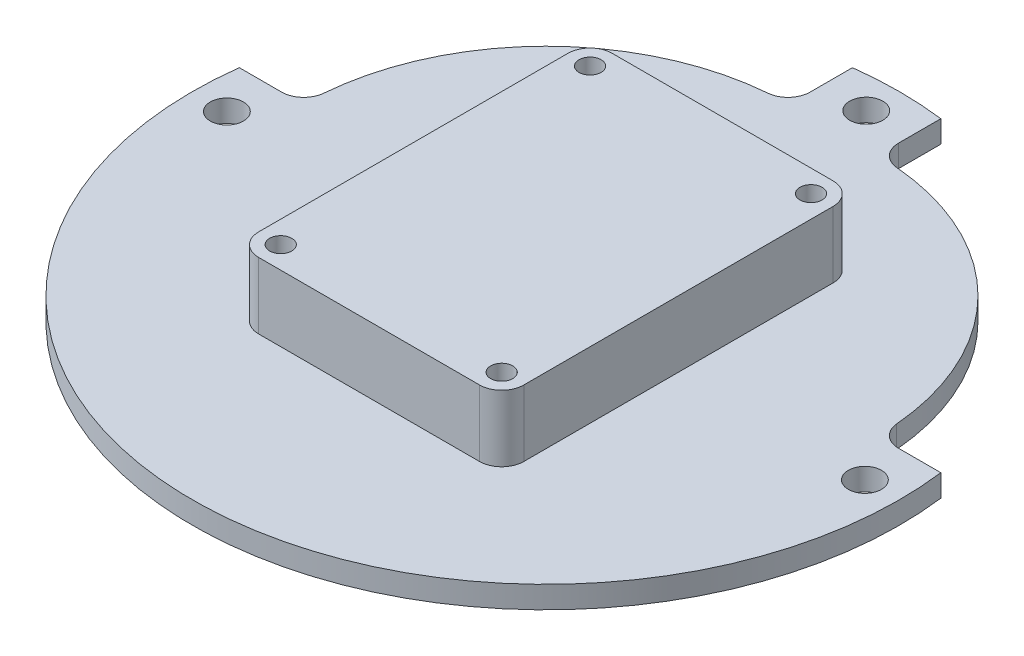
ISO-10303-21;
HEADER;
FILE_DESCRIPTION(('STEP AP214'),'2;1');
FILE_NAME('part.step','',(''),(''),'','','');
FILE_SCHEMA(('AUTOMOTIVE_DESIGN { 1 0 10303 214 1 1 1 1 }'));
ENDSEC;
DATA;
#1=APPLICATION_CONTEXT('core data for automotive mechanical design processes');
#2=APPLICATION_PROTOCOL_DEFINITION('international standard','automotive_design',2000,#1);
#3=PRODUCT_CONTEXT('',#1,'mechanical');
#4=PRODUCT('Part','Part','',(#3));
#5=PRODUCT_RELATED_PRODUCT_CATEGORY('part','',(#4));
#6=PRODUCT_DEFINITION_FORMATION('','',#4);
#7=PRODUCT_DEFINITION_CONTEXT('part definition',#1,'design');
#8=PRODUCT_DEFINITION('design','',#6,#7);
#9=PRODUCT_DEFINITION_SHAPE('','',#8);
#10=(LENGTH_UNIT() NAMED_UNIT(*) SI_UNIT(.MILLI.,.METRE.));
#11=(NAMED_UNIT(*) PLANE_ANGLE_UNIT() SI_UNIT($,.RADIAN.));
#12=(NAMED_UNIT(*) SI_UNIT($,.STERADIAN.) SOLID_ANGLE_UNIT());
#13=UNCERTAINTY_MEASURE_WITH_UNIT(LENGTH_MEASURE(1.E-05),#10,'distance_accuracy_value','');
#14=(GEOMETRIC_REPRESENTATION_CONTEXT(3) GLOBAL_UNCERTAINTY_ASSIGNED_CONTEXT((#13)) GLOBAL_UNIT_ASSIGNED_CONTEXT((#10,
#11,#12)) REPRESENTATION_CONTEXT('',''));
#15=CARTESIAN_POINT('',(0.,0.,0.));
#16=DIRECTION('',(0.,0.,1.));
#17=DIRECTION('',(1.,0.,0.));
#18=AXIS2_PLACEMENT_3D('',#15,#16,#17);
#19=CARTESIAN_POINT('',(0.,25.4,-50.8));
#20=DIRECTION('',(0.,0.,-1.));
#21=DIRECTION('',(-1.,0.,0.));
#22=AXIS2_PLACEMENT_3D('',#19,#20,#21);
#23=PLANE('',#22);
#24=DIRECTION('',(1.,0.,0.));
#25=VECTOR('',#24,1.);
#26=CARTESIAN_POINT('',(0.,6.35,-50.8));
#27=LINE('',#26,#25);
#28=CARTESIAN_POINT('',(-31.75,6.35,-50.8));
#29=VERTEX_POINT('',#28);
#30=CARTESIAN_POINT('',(31.75,6.35,-50.8));
#31=VERTEX_POINT('',#30);
#32=EDGE_CURVE('E59',#29,#31,#27,.T.);
#33=ORIENTED_EDGE('',*,*,#32,.F.);
#34=DIRECTION('',(0.,-1.,0.));
#35=VECTOR('',#34,1.);
#36=CARTESIAN_POINT('',(-31.75,25.4,-50.8));
#37=LINE('',#36,#35);
#38=CARTESIAN_POINT('',(-31.75,25.4,-50.8));
#39=VERTEX_POINT('',#38);
#40=EDGE_CURVE('E11',#39,#29,#37,.T.);
#41=ORIENTED_EDGE('',*,*,#40,.F.);
#42=DIRECTION('',(1.,0.,0.));
#43=VECTOR('',#42,1.);
#44=CARTESIAN_POINT('',(0.,25.4,-50.8));
#45=LINE('',#44,#43);
#46=CARTESIAN_POINT('',(31.75,25.4,-50.8));
#47=VERTEX_POINT('',#46);
#48=EDGE_CURVE('E205',#39,#47,#45,.T.);
#49=ORIENTED_EDGE('',*,*,#48,.T.);
#50=DIRECTION('',(0.,-1.,0.));
#51=VECTOR('',#50,1.);
#52=CARTESIAN_POINT('',(31.75,25.4,-50.8));
#53=LINE('',#52,#51);
#54=EDGE_CURVE('E195',#47,#31,#53,.T.);
#55=ORIENTED_EDGE('',*,*,#54,.T.);
#56=EDGE_LOOP('',(#33,#41,#49,#55));
#57=FACE_BOUND('',#56,.T.);
#58=ADVANCED_FACE('F43',(#57),#23,.T.);
#59=CARTESIAN_POINT('',(-31.75,25.4,-44.45));
#60=DIRECTION('',(0.,-1.,0.));
#61=DIRECTION('',(0.,0.,-1.));
#62=AXIS2_PLACEMENT_3D('',#59,#60,#61);
#63=CYLINDRICAL_SURFACE('',#62,6.35);
#64=ORIENTED_EDGE('',*,*,#40,.T.);
#65=CARTESIAN_POINT('',(-31.75,6.35,-44.45));
#66=DIRECTION('',(0.,1.,0.));
#67=DIRECTION('',(0.,0.,1.));
#68=AXIS2_PLACEMENT_3D('',#65,#66,#67);
#69=CIRCLE('',#68,6.35);
#70=CARTESIAN_POINT('',(-38.1,6.35,-44.4499999999999));
#71=VERTEX_POINT('',#70);
#72=EDGE_CURVE('E180',#29,#71,#69,.T.);
#73=ORIENTED_EDGE('',*,*,#72,.T.);
#74=DIRECTION('',(0.,-1.,0.));
#75=VECTOR('',#74,1.);
#76=CARTESIAN_POINT('',(-38.1,25.4,-44.4499999999999));
#77=LINE('',#76,#75);
#78=CARTESIAN_POINT('',(-38.1,25.4,-44.4499999999999));
#79=VERTEX_POINT('',#78);
#80=EDGE_CURVE('E52',#79,#71,#77,.T.);
#81=ORIENTED_EDGE('',*,*,#80,.F.);
#82=CARTESIAN_POINT('',(-31.75,25.4,-44.45));
#83=DIRECTION('',(0.,1.,0.));
#84=DIRECTION('',(0.,0.,1.));
#85=AXIS2_PLACEMENT_3D('',#82,#83,#84);
#86=CIRCLE('',#85,6.35);
#87=EDGE_CURVE('E200',#39,#79,#86,.T.);
#88=ORIENTED_EDGE('',*,*,#87,.F.);
#89=EDGE_LOOP('',(#64,#73,#81,#88));
#90=FACE_BOUND('',#89,.T.);
#91=ADVANCED_FACE('F199',(#90),#63,.T.);
#92=CARTESIAN_POINT('',(-38.1,25.4,0.));
#93=DIRECTION('',(-1.,0.,0.));
#94=DIRECTION('',(0.,0.,1.));
#95=AXIS2_PLACEMENT_3D('',#92,#93,#94);
#96=PLANE('',#95);
#97=DIRECTION('',(0.,0.,-1.));
#98=VECTOR('',#97,1.);
#99=CARTESIAN_POINT('',(-38.1,6.35,0.));
#100=LINE('',#99,#98);
#101=CARTESIAN_POINT('',(-38.1,6.35,44.45));
#102=VERTEX_POINT('',#101);
#103=EDGE_CURVE('E184',#102,#71,#100,.T.);
#104=ORIENTED_EDGE('',*,*,#103,.F.);
#105=DIRECTION('',(0.,-1.,0.));
#106=VECTOR('',#105,1.);
#107=CARTESIAN_POINT('',(-38.1,25.4,44.45));
#108=LINE('',#107,#106);
#109=CARTESIAN_POINT('',(-38.1,25.4,44.45));
#110=VERTEX_POINT('',#109);
#111=EDGE_CURVE('E272',#110,#102,#108,.T.);
#112=ORIENTED_EDGE('',*,*,#111,.F.);
#113=DIRECTION('',(0.,0.,-1.));
#114=VECTOR('',#113,1.);
#115=CARTESIAN_POINT('',(-38.1,25.4,0.));
#116=LINE('',#115,#114);
#117=EDGE_CURVE('E204',#110,#79,#116,.T.);
#118=ORIENTED_EDGE('',*,*,#117,.T.);
#119=ORIENTED_EDGE('',*,*,#80,.T.);
#120=EDGE_LOOP('',(#104,#112,#118,#119));
#121=FACE_BOUND('',#120,.T.);
#122=ADVANCED_FACE('F277',(#121),#96,.T.);
#123=CARTESIAN_POINT('',(-31.75,25.4,44.45));
#124=DIRECTION('',(0.,-1.,0.));
#125=DIRECTION('',(0.,0.,-1.));
#126=AXIS2_PLACEMENT_3D('',#123,#124,#125);
#127=CYLINDRICAL_SURFACE('',#126,6.35);
#128=ORIENTED_EDGE('',*,*,#111,.T.);
#129=CARTESIAN_POINT('',(-31.75,6.35,44.45));
#130=DIRECTION('',(0.,1.,0.));
#131=DIRECTION('',(0.,0.,1.));
#132=AXIS2_PLACEMENT_3D('',#129,#130,#131);
#133=CIRCLE('',#132,6.35);
#134=CARTESIAN_POINT('',(-31.75,6.35,50.8));
#135=VERTEX_POINT('',#134);
#136=EDGE_CURVE('E284',#102,#135,#133,.T.);
#137=ORIENTED_EDGE('',*,*,#136,.T.);
#138=DIRECTION('',(0.,-1.,0.));
#139=VECTOR('',#138,1.);
#140=CARTESIAN_POINT('',(-31.75,25.4,50.8));
#141=LINE('',#140,#139);
#142=CARTESIAN_POINT('',(-31.75,25.4,50.8));
#143=VERTEX_POINT('',#142);
#144=EDGE_CURVE('E268',#143,#135,#141,.T.);
#145=ORIENTED_EDGE('',*,*,#144,.F.);
#146=CARTESIAN_POINT('',(-31.75,25.4,44.45));
#147=DIRECTION('',(0.,1.,0.));
#148=DIRECTION('',(0.,0.,1.));
#149=AXIS2_PLACEMENT_3D('',#146,#147,#148);
#150=CIRCLE('',#149,6.35);
#151=EDGE_CURVE('E219',#110,#143,#150,.T.);
#152=ORIENTED_EDGE('',*,*,#151,.F.);
#153=EDGE_LOOP('',(#128,#137,#145,#152));
#154=FACE_BOUND('',#153,.T.);
#155=ADVANCED_FACE('F283',(#154),#127,.T.);
#156=CARTESIAN_POINT('',(0.,25.4,50.8));
#157=DIRECTION('',(0.,0.,-1.));
#158=DIRECTION('',(-1.,0.,0.));
#159=AXIS2_PLACEMENT_3D('',#156,#157,#158);
#160=PLANE('',#159);
#161=ORIENTED_EDGE('',*,*,#144,.T.);
#162=DIRECTION('',(1.,0.,0.));
#163=VECTOR('',#162,1.);
#164=CARTESIAN_POINT('',(0.,6.35,50.8));
#165=LINE('',#164,#163);
#166=CARTESIAN_POINT('',(31.75,6.35,50.8));
#167=VERTEX_POINT('',#166);
#168=EDGE_CURVE('E288',#135,#167,#165,.T.);
#169=ORIENTED_EDGE('',*,*,#168,.T.);
#170=DIRECTION('',(0.,-1.,0.));
#171=VECTOR('',#170,1.);
#172=CARTESIAN_POINT('',(31.75,25.4,50.8));
#173=LINE('',#172,#171);
#174=CARTESIAN_POINT('',(31.75,25.4,50.8));
#175=VERTEX_POINT('',#174);
#176=EDGE_CURVE('E264',#175,#167,#173,.T.);
#177=ORIENTED_EDGE('',*,*,#176,.F.);
#178=DIRECTION('',(1.,0.,0.));
#179=VECTOR('',#178,1.);
#180=CARTESIAN_POINT('',(0.,25.4,50.8));
#181=LINE('',#180,#179);
#182=EDGE_CURVE('E223',#143,#175,#181,.T.);
#183=ORIENTED_EDGE('',*,*,#182,.F.);
#184=EDGE_LOOP('',(#161,#169,#177,#183));
#185=FACE_BOUND('',#184,.T.);
#186=ADVANCED_FACE('F287',(#185),#160,.F.);
#187=CARTESIAN_POINT('',(31.75,25.4,44.45));
#188=DIRECTION('',(0.,-1.,0.));
#189=DIRECTION('',(0.,0.,-1.));
#190=AXIS2_PLACEMENT_3D('',#187,#188,#189);
#191=CYLINDRICAL_SURFACE('',#190,6.35);
#192=ORIENTED_EDGE('',*,*,#176,.T.);
#193=CARTESIAN_POINT('',(31.75,6.35,44.45));
#194=DIRECTION('',(0.,1.,0.));
#195=DIRECTION('',(0.,0.,1.));
#196=AXIS2_PLACEMENT_3D('',#193,#194,#195);
#197=CIRCLE('',#196,6.35);
#198=CARTESIAN_POINT('',(38.1,6.35,44.45));
#199=VERTEX_POINT('',#198);
#200=EDGE_CURVE('E293',#167,#199,#197,.T.);
#201=ORIENTED_EDGE('',*,*,#200,.T.);
#202=DIRECTION('',(0.,-1.,0.));
#203=VECTOR('',#202,1.);
#204=CARTESIAN_POINT('',(38.1,25.4,44.45));
#205=LINE('',#204,#203);
#206=CARTESIAN_POINT('',(38.1,25.4,44.45));
#207=VERTEX_POINT('',#206);
#208=EDGE_CURVE('E260',#207,#199,#205,.T.);
#209=ORIENTED_EDGE('',*,*,#208,.F.);
#210=CARTESIAN_POINT('',(31.75,25.4,44.45));
#211=DIRECTION('',(0.,1.,0.));
#212=DIRECTION('',(0.,0.,1.));
#213=AXIS2_PLACEMENT_3D('',#210,#211,#212);
#214=CIRCLE('',#213,6.35);
#215=EDGE_CURVE('E227',#175,#207,#214,.T.);
#216=ORIENTED_EDGE('',*,*,#215,.F.);
#217=EDGE_LOOP('',(#192,#201,#209,#216));
#218=FACE_BOUND('',#217,.T.);
#219=ADVANCED_FACE('F291',(#218),#191,.T.);
#220=CARTESIAN_POINT('',(38.1,25.4,0.));
#221=DIRECTION('',(-1.,0.,0.));
#222=DIRECTION('',(0.,0.,1.));
#223=AXIS2_PLACEMENT_3D('',#220,#221,#222);
#224=PLANE('',#223);
#225=ORIENTED_EDGE('',*,*,#208,.T.);
#226=DIRECTION('',(0.,0.,-1.));
#227=VECTOR('',#226,1.);
#228=CARTESIAN_POINT('',(38.1,6.35,0.));
#229=LINE('',#228,#227);
#230=CARTESIAN_POINT('',(38.1,6.35,-44.4499999999999));
#231=VERTEX_POINT('',#230);
#232=EDGE_CURVE('E298',#199,#231,#229,.T.);
#233=ORIENTED_EDGE('',*,*,#232,.T.);
#234=DIRECTION('',(0.,-1.,0.));
#235=VECTOR('',#234,1.);
#236=CARTESIAN_POINT('',(38.1,25.4,-44.4499999999999));
#237=LINE('',#236,#235);
#238=CARTESIAN_POINT('',(38.1,25.4,-44.4499999999999));
#239=VERTEX_POINT('',#238);
#240=EDGE_CURVE('E256',#239,#231,#237,.T.);
#241=ORIENTED_EDGE('',*,*,#240,.F.);
#242=DIRECTION('',(0.,0.,-1.));
#243=VECTOR('',#242,1.);
#244=CARTESIAN_POINT('',(38.1,25.4,0.));
#245=LINE('',#244,#243);
#246=EDGE_CURVE('E231',#207,#239,#245,.T.);
#247=ORIENTED_EDGE('',*,*,#246,.F.);
#248=EDGE_LOOP('',(#225,#233,#241,#247));
#249=FACE_BOUND('',#248,.T.);
#250=ADVANCED_FACE('F297',(#249),#224,.F.);
#251=CARTESIAN_POINT('',(-31.75,25.4,-44.45));
#252=DIRECTION('',(0.,-1.,0.));
#253=DIRECTION('',(0.,0.,-1.));
#254=AXIS2_PLACEMENT_3D('',#251,#252,#253);
#255=CYLINDRICAL_SURFACE('',#254,3.175);
#256=CARTESIAN_POINT('',(-31.75,25.4,-44.45));
#257=DIRECTION('',(0.,1.,0.));
#258=DIRECTION('',(0.,0.,1.));
#259=AXIS2_PLACEMENT_3D('',#256,#257,#258);
#260=CIRCLE('',#259,3.175);
#261=CARTESIAN_POINT('',(-31.75,25.4,-41.275));
#262=VERTEX_POINT('',#261);
#263=EDGE_CURVE('E209',#262,#262,#260,.T.);
#264=ORIENTED_EDGE('',*,*,#263,.T.);
#265=EDGE_LOOP('',(#264));
#266=FACE_BOUND('',#265,.T.);
#267=CARTESIAN_POINT('',(-31.75,0.,-44.45));
#268=DIRECTION('',(0.,1.,0.));
#269=DIRECTION('',(0.,0.,1.));
#270=AXIS2_PLACEMENT_3D('',#267,#268,#269);
#271=CIRCLE('',#270,3.175);
#272=CARTESIAN_POINT('',(-31.75,0.,-41.275));
#273=VERTEX_POINT('',#272);
#274=EDGE_CURVE('E249',#273,#273,#271,.T.);
#275=ORIENTED_EDGE('',*,*,#274,.F.);
#276=EDGE_LOOP('',(#275));
#277=FACE_BOUND('',#276,.T.);
#278=ADVANCED_FACE('F477',(#266,#277),#255,.F.);
#279=CARTESIAN_POINT('',(31.75,25.4,-44.45));
#280=DIRECTION('',(0.,-1.,0.));
#281=DIRECTION('',(0.,0.,-1.));
#282=AXIS2_PLACEMENT_3D('',#279,#280,#281);
#283=CYLINDRICAL_SURFACE('',#282,3.175);
#284=CARTESIAN_POINT('',(31.75,25.4,-44.45));
#285=DIRECTION('',(0.,1.,0.));
#286=DIRECTION('',(0.,0.,1.));
#287=AXIS2_PLACEMENT_3D('',#284,#285,#286);
#288=CIRCLE('',#287,3.175);
#289=CARTESIAN_POINT('',(31.75,25.4,-41.275));
#290=VERTEX_POINT('',#289);
#291=EDGE_CURVE('E213',#290,#290,#288,.T.);
#292=ORIENTED_EDGE('',*,*,#291,.T.);
#293=EDGE_LOOP('',(#292));
#294=FACE_BOUND('',#293,.T.);
#295=CARTESIAN_POINT('',(31.75,0.,-44.45));
#296=DIRECTION('',(0.,1.,0.));
#297=DIRECTION('',(0.,0.,1.));
#298=AXIS2_PLACEMENT_3D('',#295,#296,#297);
#299=CIRCLE('',#298,3.175);
#300=CARTESIAN_POINT('',(31.75,0.,-41.275));
#301=VERTEX_POINT('',#300);
#302=EDGE_CURVE('E245',#301,#301,#299,.T.);
#303=ORIENTED_EDGE('',*,*,#302,.F.);
#304=EDGE_LOOP('',(#303));
#305=FACE_BOUND('',#304,.T.);
#306=ADVANCED_FACE('F467',(#294,#305),#283,.F.);
#307=CARTESIAN_POINT('',(-31.75,25.4,44.45));
#308=DIRECTION('',(0.,-1.,0.));
#309=DIRECTION('',(0.,0.,-1.));
#310=AXIS2_PLACEMENT_3D('',#307,#308,#309);
#311=CYLINDRICAL_SURFACE('',#310,3.175);
#312=CARTESIAN_POINT('',(-31.75,25.4,44.45));
#313=DIRECTION('',(0.,1.,0.));
#314=DIRECTION('',(0.,0.,1.));
#315=AXIS2_PLACEMENT_3D('',#312,#313,#314);
#316=CIRCLE('',#315,3.175);
#317=CARTESIAN_POINT('',(-31.75,25.4,47.625));
#318=VERTEX_POINT('',#317);
#319=EDGE_CURVE('E460',#318,#318,#316,.T.);
#320=ORIENTED_EDGE('',*,*,#319,.T.);
#321=EDGE_LOOP('',(#320));
#322=FACE_BOUND('',#321,.T.);
#323=CARTESIAN_POINT('',(-31.75,0.,44.45));
#324=DIRECTION('',(0.,1.,0.));
#325=DIRECTION('',(0.,0.,1.));
#326=AXIS2_PLACEMENT_3D('',#323,#324,#325);
#327=CIRCLE('',#326,3.175);
#328=CARTESIAN_POINT('',(-31.75,0.,47.625));
#329=VERTEX_POINT('',#328);
#330=EDGE_CURVE('E240',#329,#329,#327,.T.);
#331=ORIENTED_EDGE('',*,*,#330,.F.);
#332=EDGE_LOOP('',(#331));
#333=FACE_BOUND('',#332,.T.);
#334=ADVANCED_FACE('F559',(#322,#333),#311,.F.);
#335=CARTESIAN_POINT('',(31.75,25.4,44.45));
#336=DIRECTION('',(0.,-1.,0.));
#337=DIRECTION('',(0.,0.,-1.));
#338=AXIS2_PLACEMENT_3D('',#335,#336,#337);
#339=CYLINDRICAL_SURFACE('',#338,3.175);
#340=CARTESIAN_POINT('',(31.75,25.4,44.45));
#341=DIRECTION('',(0.,1.,0.));
#342=DIRECTION('',(0.,0.,1.));
#343=AXIS2_PLACEMENT_3D('',#340,#341,#342);
#344=CIRCLE('',#343,3.175);
#345=CARTESIAN_POINT('',(31.75,25.4,47.625));
#346=VERTEX_POINT('',#345);
#347=EDGE_CURVE('E253',#346,#346,#344,.T.);
#348=ORIENTED_EDGE('',*,*,#347,.T.);
#349=EDGE_LOOP('',(#348));
#350=FACE_BOUND('',#349,.T.);
#351=CARTESIAN_POINT('',(31.75,0.,44.45));
#352=DIRECTION('',(0.,1.,0.));
#353=DIRECTION('',(0.,0.,1.));
#354=AXIS2_PLACEMENT_3D('',#351,#352,#353);
#355=CIRCLE('',#354,3.175);
#356=CARTESIAN_POINT('',(31.75,0.,47.625));
#357=VERTEX_POINT('',#356);
#358=EDGE_CURVE('E236',#357,#357,#355,.T.);
#359=ORIENTED_EDGE('',*,*,#358,.F.);
#360=EDGE_LOOP('',(#359));
#361=FACE_BOUND('',#360,.T.);
#362=ADVANCED_FACE('F45',(#350,#361),#339,.F.);
#363=CARTESIAN_POINT('',(31.75,25.4,-44.45));
#364=DIRECTION('',(0.,-1.,0.));
#365=DIRECTION('',(0.,0.,-1.));
#366=AXIS2_PLACEMENT_3D('',#363,#364,#365);
#367=CYLINDRICAL_SURFACE('',#366,6.35);
#368=ORIENTED_EDGE('',*,*,#240,.T.);
#369=CARTESIAN_POINT('',(31.75,6.35,-44.45));
#370=DIRECTION('',(0.,1.,0.));
#371=DIRECTION('',(0.,0.,1.));
#372=AXIS2_PLACEMENT_3D('',#369,#370,#371);
#373=CIRCLE('',#372,6.35);
#374=EDGE_CURVE('E197',#231,#31,#373,.T.);
#375=ORIENTED_EDGE('',*,*,#374,.T.);
#376=ORIENTED_EDGE('',*,*,#54,.F.);
#377=CARTESIAN_POINT('',(31.75,25.4,-44.45));
#378=DIRECTION('',(0.,1.,0.));
#379=DIRECTION('',(0.,0.,1.));
#380=AXIS2_PLACEMENT_3D('',#377,#378,#379);
#381=CIRCLE('',#380,6.35);
#382=EDGE_CURVE('E67',#239,#47,#381,.T.);
#383=ORIENTED_EDGE('',*,*,#382,.F.);
#384=EDGE_LOOP('',(#368,#375,#376,#383));
#385=FACE_BOUND('',#384,.T.);
#386=ADVANCED_FACE('F300',(#385),#367,.T.);
#387=CARTESIAN_POINT('',(0.,25.4,0.));
#388=DIRECTION('',(0.,1.,0.));
#389=DIRECTION('',(0.,0.,1.));
#390=AXIS2_PLACEMENT_3D('',#387,#388,#389);
#391=PLANE('',#390);
#392=ORIENTED_EDGE('',*,*,#347,.F.);
#393=EDGE_LOOP('',(#392));
#394=FACE_BOUND('',#393,.T.);
#395=ORIENTED_EDGE('',*,*,#319,.F.);
#396=EDGE_LOOP('',(#395));
#397=FACE_BOUND('',#396,.T.);
#398=ORIENTED_EDGE('',*,*,#291,.F.);
#399=EDGE_LOOP('',(#398));
#400=FACE_BOUND('',#399,.T.);
#401=ORIENTED_EDGE('',*,*,#263,.F.);
#402=EDGE_LOOP('',(#401));
#403=FACE_BOUND('',#402,.T.);
#404=ORIENTED_EDGE('',*,*,#48,.F.);
#405=ORIENTED_EDGE('',*,*,#87,.T.);
#406=ORIENTED_EDGE('',*,*,#117,.F.);
#407=ORIENTED_EDGE('',*,*,#151,.T.);
#408=ORIENTED_EDGE('',*,*,#182,.T.);
#409=ORIENTED_EDGE('',*,*,#215,.T.);
#410=ORIENTED_EDGE('',*,*,#246,.T.);
#411=ORIENTED_EDGE('',*,*,#382,.T.);
#412=EDGE_LOOP('',(#404,#405,#406,#407,#408,#409,#410,#411));
#413=FACE_BOUND('',#412,.T.);
#414=ADVANCED_FACE('F207',(#394,#397,#400,#403,#413),#391,.T.);
#415=CARTESIAN_POINT('',(0.,0.,0.));
#416=DIRECTION('',(0.,1.,0.));
#417=DIRECTION('',(0.,0.,1.));
#418=AXIS2_PLACEMENT_3D('',#415,#416,#417);
#419=PLANE('',#418);
#420=ORIENTED_EDGE('',*,*,#358,.T.);
#421=EDGE_LOOP('',(#420));
#422=FACE_BOUND('',#421,.T.);
#423=ORIENTED_EDGE('',*,*,#330,.T.);
#424=EDGE_LOOP('',(#423));
#425=FACE_BOUND('',#424,.T.);
#426=ORIENTED_EDGE('',*,*,#302,.T.);
#427=EDGE_LOOP('',(#426));
#428=FACE_BOUND('',#427,.T.);
#429=ORIENTED_EDGE('',*,*,#274,.T.);
#430=EDGE_LOOP('',(#429));
#431=FACE_BOUND('',#430,.T.);
#432=CARTESIAN_POINT('',(91.6765624757804,0.,0.));
#433=DIRECTION('',(0.,1.,0.));
#434=DIRECTION('',(0.,0.,1.));
#435=AXIS2_PLACEMENT_3D('',#432,#433,#434);
#436=CIRCLE('',#435,4.7625);
#437=CARTESIAN_POINT('',(91.6765624757804,0.,4.7625));
#438=VERTEX_POINT('',#437);
#439=EDGE_CURVE('E360',#438,#438,#436,.F.);
#440=ORIENTED_EDGE('',*,*,#439,.F.);
#441=EDGE_LOOP('',(#440));
#442=FACE_BOUND('',#441,.T.);
#443=CARTESIAN_POINT('',(-91.6765624757804,0.,0.));
#444=DIRECTION('',(0.,1.,0.));
#445=DIRECTION('',(0.,0.,1.));
#446=AXIS2_PLACEMENT_3D('',#443,#444,#445);
#447=CIRCLE('',#446,4.7625);
#448=CARTESIAN_POINT('',(-91.6765624757804,0.,4.7625));
#449=VERTEX_POINT('',#448);
#450=EDGE_CURVE('E364',#449,#449,#447,.T.);
#451=ORIENTED_EDGE('',*,*,#450,.T.);
#452=EDGE_LOOP('',(#451));
#453=FACE_BOUND('',#452,.T.);
#454=CARTESIAN_POINT('',(0.,0.,-92.075));
#455=DIRECTION('',(0.,1.,0.));
#456=DIRECTION('',(0.,0.,1.));
#457=AXIS2_PLACEMENT_3D('',#454,#455,#456);
#458=CIRCLE('',#457,4.7625);
#459=CARTESIAN_POINT('',(0.,0.,-87.3125));
#460=VERTEX_POINT('',#459);
#461=EDGE_CURVE('E368',#460,#460,#458,.T.);
#462=ORIENTED_EDGE('',*,*,#461,.T.);
#463=EDGE_LOOP('',(#462));
#464=FACE_BOUND('',#463,.T.);
#465=CARTESIAN_POINT('',(-12.7,0.,-12.7));
#466=DIRECTION('',(0.,1.,0.));
#467=DIRECTION('',(0.,0.,1.));
#468=AXIS2_PLACEMENT_3D('',#465,#466,#467);
#469=CIRCLE('',#468,69.85);
#470=CARTESIAN_POINT('',(-82.307042742136,0.,-18.5208333333334));
#471=VERTEX_POINT('',#470);
#472=CARTESIAN_POINT('',(-18.5208333333333,0.,-82.307042742136));
#473=VERTEX_POINT('',#472);
#474=EDGE_CURVE('E372',#471,#473,#469,.F.);
#475=ORIENTED_EDGE('',*,*,#474,.T.);
#476=CARTESIAN_POINT('',(-19.05,0.,-88.6349557186939));
#477=DIRECTION('',(0.,1.,0.));
#478=DIRECTION('',(0.,0.,1.));
#479=AXIS2_PLACEMENT_3D('',#476,#477,#478);
#480=CIRCLE('',#479,6.35);
#481=CARTESIAN_POINT('',(-12.7,0.,-88.6349557186939));
#482=VERTEX_POINT('',#481);
#483=EDGE_CURVE('E416',#473,#482,#480,.T.);
#484=ORIENTED_EDGE('',*,*,#483,.T.);
#485=DIRECTION('',(0.,0.,1.));
#486=VECTOR('',#485,1.);
#487=CARTESIAN_POINT('',(-12.7,0.,0.));
#488=LINE('',#487,#486);
#489=CARTESIAN_POINT('',(-12.7,0.,-100.803124951561));
#490=VERTEX_POINT('',#489);
#491=EDGE_CURVE('E412',#490,#482,#488,.T.);
#492=ORIENTED_EDGE('',*,*,#491,.F.);
#493=CARTESIAN_POINT('',(0.,0.,0.));
#494=DIRECTION('',(0.,1.,0.));
#495=DIRECTION('',(0.,0.,1.));
#496=AXIS2_PLACEMENT_3D('',#493,#494,#495);
#497=CIRCLE('',#496,101.6);
#498=CARTESIAN_POINT('',(12.7,0.,-100.803124951561));
#499=VERTEX_POINT('',#498);
#500=EDGE_CURVE('E408',#499,#490,#497,.T.);
#501=ORIENTED_EDGE('',*,*,#500,.F.);
#502=DIRECTION('',(0.,0.,1.));
#503=VECTOR('',#502,1.);
#504=CARTESIAN_POINT('',(12.7,0.,0.));
#505=LINE('',#504,#503);
#506=CARTESIAN_POINT('',(12.7,0.,-88.6349557186938));
#507=VERTEX_POINT('',#506);
#508=EDGE_CURVE('E404',#499,#507,#505,.T.);
#509=ORIENTED_EDGE('',*,*,#508,.T.);
#510=CARTESIAN_POINT('',(19.05,0.,-88.6349557186938));
#511=DIRECTION('',(0.,1.,0.));
#512=DIRECTION('',(0.,0.,1.));
#513=AXIS2_PLACEMENT_3D('',#510,#511,#512);
#514=CIRCLE('',#513,6.34999999999999);
#515=CARTESIAN_POINT('',(18.5208333333333,0.,-82.3070427421361));
#516=VERTEX_POINT('',#515);
#517=EDGE_CURVE('E400',#507,#516,#514,.T.);
#518=ORIENTED_EDGE('',*,*,#517,.T.);
#519=CARTESIAN_POINT('',(12.6999999999998,0.,-12.6999999999998));
#520=DIRECTION('',(0.,1.,0.));
#521=DIRECTION('',(0.,0.,1.));
#522=AXIS2_PLACEMENT_3D('',#519,#520,#521);
#523=CIRCLE('',#522,69.8500000000002);
#524=CARTESIAN_POINT('',(82.3070427421361,0.,-18.5208333333333));
#525=VERTEX_POINT('',#524);
#526=EDGE_CURVE('E396',#516,#525,#523,.F.);
#527=ORIENTED_EDGE('',*,*,#526,.T.);
#528=CARTESIAN_POINT('',(88.6349557186938,0.,-19.05));
#529=DIRECTION('',(0.,1.,0.));
#530=DIRECTION('',(0.,0.,1.));
#531=AXIS2_PLACEMENT_3D('',#528,#529,#530);
#532=CIRCLE('',#531,6.34999999999999);
#533=CARTESIAN_POINT('',(88.6349557186938,0.,-12.7));
#534=VERTEX_POINT('',#533);
#535=EDGE_CURVE('E392',#525,#534,#532,.T.);
#536=ORIENTED_EDGE('',*,*,#535,.T.);
#537=DIRECTION('',(-1.,0.,0.));
#538=VECTOR('',#537,1.);
#539=CARTESIAN_POINT('',(0.,0.,-12.7));
#540=LINE('',#539,#538);
#541=CARTESIAN_POINT('',(100.803124951561,0.,-12.7));
#542=VERTEX_POINT('',#541);
#543=EDGE_CURVE('E388',#542,#534,#540,.T.);
#544=ORIENTED_EDGE('',*,*,#543,.F.);
#545=CARTESIAN_POINT('',(0.,0.,0.));
#546=DIRECTION('',(0.,1.,0.));
#547=DIRECTION('',(0.,0.,1.));
#548=AXIS2_PLACEMENT_3D('',#545,#546,#547);
#549=CIRCLE('',#548,101.6);
#550=CARTESIAN_POINT('',(-100.803124951561,0.,-12.7));
#551=VERTEX_POINT('',#550);
#552=EDGE_CURVE('E384',#551,#542,#549,.T.);
#553=ORIENTED_EDGE('',*,*,#552,.F.);
#554=DIRECTION('',(1.,0.,0.));
#555=VECTOR('',#554,1.);
#556=CARTESIAN_POINT('',(0.,0.,-12.7));
#557=LINE('',#556,#555);
#558=CARTESIAN_POINT('',(-88.6349557186939,0.,-12.7));
#559=VERTEX_POINT('',#558);
#560=EDGE_CURVE('E380',#551,#559,#557,.T.);
#561=ORIENTED_EDGE('',*,*,#560,.T.);
#562=CARTESIAN_POINT('',(-88.6349557186939,0.,-19.05));
#563=DIRECTION('',(0.,1.,0.));
#564=DIRECTION('',(0.,0.,1.));
#565=AXIS2_PLACEMENT_3D('',#562,#563,#564);
#566=CIRCLE('',#565,6.35000000000001);
#567=EDGE_CURVE('E376',#471,#559,#566,.F.);
#568=ORIENTED_EDGE('',*,*,#567,.F.);
#569=EDGE_LOOP('',(#475,#484,#492,#501,#509,#518,#527,#536,#544,#553,#561,#568));
#570=FACE_BOUND('',#569,.T.);
#571=ADVANCED_FACE('F472',(#422,#425,#428,#431,#442,#453,#464,#570),#419,.F.);
#572=CARTESIAN_POINT('',(-12.7,6.35,-12.7));
#573=DIRECTION('',(0.,-1.,0.));
#574=DIRECTION('',(0.,0.,-1.));
#575=AXIS2_PLACEMENT_3D('',#572,#573,#574);
#576=CYLINDRICAL_SURFACE('',#575,69.85);
#577=ORIENTED_EDGE('',*,*,#474,.F.);
#578=DIRECTION('',(0.,-1.,0.));
#579=VECTOR('',#578,1.);
#580=CARTESIAN_POINT('',(-82.307042742136,6.35,-18.5208333333334));
#581=LINE('',#580,#579);
#582=CARTESIAN_POINT('',(-82.307042742136,6.35,-18.5208333333334));
#583=VERTEX_POINT('',#582);
#584=EDGE_CURVE('E241',#583,#471,#581,.T.);
#585=ORIENTED_EDGE('',*,*,#584,.F.);
#586=CARTESIAN_POINT('',(-12.7,6.35,-12.7));
#587=DIRECTION('',(0.,1.,0.));
#588=DIRECTION('',(0.,0.,1.));
#589=AXIS2_PLACEMENT_3D('',#586,#587,#588);
#590=CIRCLE('',#589,69.85);
#591=CARTESIAN_POINT('',(-18.5208333333333,6.35,-82.307042742136));
#592=VERTEX_POINT('',#591);
#593=EDGE_CURVE('E314',#583,#592,#590,.F.);
#594=ORIENTED_EDGE('',*,*,#593,.T.);
#595=DIRECTION('',(0.,-1.,0.));
#596=VECTOR('',#595,1.);
#597=CARTESIAN_POINT('',(-18.5208333333333,6.35,-82.307042742136));
#598=LINE('',#597,#596);
#599=EDGE_CURVE('E359',#592,#473,#598,.T.);
#600=ORIENTED_EDGE('',*,*,#599,.T.);
#601=EDGE_LOOP('',(#577,#585,#594,#600));
#602=FACE_BOUND('',#601,.T.);
#603=ADVANCED_FACE('F485',(#602),#576,.T.);
#604=CARTESIAN_POINT('',(-88.6349557186939,6.35,-19.05));
#605=DIRECTION('',(0.,-1.,0.));
#606=DIRECTION('',(0.,0.,-1.));
#607=AXIS2_PLACEMENT_3D('',#604,#605,#606);
#608=CYLINDRICAL_SURFACE('',#607,6.35000000000001);
#609=ORIENTED_EDGE('',*,*,#567,.T.);
#610=DIRECTION('',(0.,-1.,0.));
#611=VECTOR('',#610,1.);
#612=CARTESIAN_POINT('',(-88.6349557186939,6.35,-12.7));
#613=LINE('',#612,#611);
#614=CARTESIAN_POINT('',(-88.6349557186939,6.35,-12.7));
#615=VERTEX_POINT('',#614);
#616=EDGE_CURVE('E452',#615,#559,#613,.T.);
#617=ORIENTED_EDGE('',*,*,#616,.F.);
#618=CARTESIAN_POINT('',(-88.6349557186939,6.35,-19.05));
#619=DIRECTION('',(0.,1.,0.));
#620=DIRECTION('',(0.,0.,1.));
#621=AXIS2_PLACEMENT_3D('',#618,#619,#620);
#622=CIRCLE('',#621,6.35000000000001);
#623=EDGE_CURVE('E318',#583,#615,#622,.F.);
#624=ORIENTED_EDGE('',*,*,#623,.F.);
#625=ORIENTED_EDGE('',*,*,#584,.T.);
#626=EDGE_LOOP('',(#609,#617,#624,#625));
#627=FACE_BOUND('',#626,.T.);
#628=ADVANCED_FACE('F538',(#627),#608,.F.);
#629=CARTESIAN_POINT('',(0.,6.35,-12.7));
#630=DIRECTION('',(0.,0.,-1.));
#631=DIRECTION('',(-1.,0.,0.));
#632=AXIS2_PLACEMENT_3D('',#629,#630,#631);
#633=PLANE('',#632);
#634=ORIENTED_EDGE('',*,*,#560,.F.);
#635=DIRECTION('',(0.,-1.,0.));
#636=VECTOR('',#635,1.);
#637=CARTESIAN_POINT('',(-100.803124951561,6.35,-12.7));
#638=LINE('',#637,#636);
#639=CARTESIAN_POINT('',(-100.803124951561,6.35,-12.7));
#640=VERTEX_POINT('',#639);
#641=EDGE_CURVE('E449',#640,#551,#638,.T.);
#642=ORIENTED_EDGE('',*,*,#641,.F.);
#643=DIRECTION('',(1.,0.,0.));
#644=VECTOR('',#643,1.);
#645=CARTESIAN_POINT('',(0.,6.35,-12.7));
#646=LINE('',#645,#644);
#647=EDGE_CURVE('E321',#640,#615,#646,.T.);
#648=ORIENTED_EDGE('',*,*,#647,.T.);
#649=ORIENTED_EDGE('',*,*,#616,.T.);
#650=EDGE_LOOP('',(#634,#642,#648,#649));
#651=FACE_BOUND('',#650,.T.);
#652=ADVANCED_FACE('F532',(#651),#633,.T.);
#653=CARTESIAN_POINT('',(0.,6.35,0.));
#654=DIRECTION('',(0.,-1.,0.));
#655=DIRECTION('',(0.,0.,-1.));
#656=AXIS2_PLACEMENT_3D('',#653,#654,#655);
#657=CYLINDRICAL_SURFACE('',#656,101.6);
#658=ORIENTED_EDGE('',*,*,#552,.T.);
#659=DIRECTION('',(0.,-1.,0.));
#660=VECTOR('',#659,1.);
#661=CARTESIAN_POINT('',(100.803124951561,6.35,-12.7));
#662=LINE('',#661,#660);
#663=CARTESIAN_POINT('',(100.803124951561,6.35,-12.7));
#664=VERTEX_POINT('',#663);
#665=EDGE_CURVE('E445',#664,#542,#662,.T.);
#666=ORIENTED_EDGE('',*,*,#665,.F.);
#667=CARTESIAN_POINT('',(0.,6.35,0.));
#668=DIRECTION('',(0.,1.,0.));
#669=DIRECTION('',(0.,0.,1.));
#670=AXIS2_PLACEMENT_3D('',#667,#668,#669);
#671=CIRCLE('',#670,101.6);
#672=EDGE_CURVE('E325',#640,#664,#671,.T.);
#673=ORIENTED_EDGE('',*,*,#672,.F.);
#674=ORIENTED_EDGE('',*,*,#641,.T.);
#675=EDGE_LOOP('',(#658,#666,#673,#674));
#676=FACE_BOUND('',#675,.T.);
#677=ADVANCED_FACE('F679',(#676),#657,.T.);
#678=CARTESIAN_POINT('',(0.,6.35,-12.7));
#679=DIRECTION('',(0.,0.,1.));
#680=DIRECTION('',(1.,0.,0.));
#681=AXIS2_PLACEMENT_3D('',#678,#679,#680);
#682=PLANE('',#681);
#683=ORIENTED_EDGE('',*,*,#543,.T.);
#684=DIRECTION('',(0.,-1.,0.));
#685=VECTOR('',#684,1.);
#686=CARTESIAN_POINT('',(88.6349557186938,6.35,-12.7));
#687=LINE('',#686,#685);
#688=CARTESIAN_POINT('',(88.6349557186938,6.35,-12.7));
#689=VERTEX_POINT('',#688);
#690=EDGE_CURVE('E442',#689,#534,#687,.T.);
#691=ORIENTED_EDGE('',*,*,#690,.F.);
#692=DIRECTION('',(-1.,0.,0.));
#693=VECTOR('',#692,1.);
#694=CARTESIAN_POINT('',(0.,6.35,-12.7));
#695=LINE('',#694,#693);
#696=EDGE_CURVE('E329',#664,#689,#695,.T.);
#697=ORIENTED_EDGE('',*,*,#696,.F.);
#698=ORIENTED_EDGE('',*,*,#665,.T.);
#699=EDGE_LOOP('',(#683,#691,#697,#698));
#700=FACE_BOUND('',#699,.T.);
#701=ADVANCED_FACE('F526',(#700),#682,.F.);
#702=CARTESIAN_POINT('',(88.6349557186938,6.35,-19.05));
#703=DIRECTION('',(0.,-1.,0.));
#704=DIRECTION('',(0.,0.,-1.));
#705=AXIS2_PLACEMENT_3D('',#702,#703,#704);
#706=CYLINDRICAL_SURFACE('',#705,6.34999999999999);
#707=ORIENTED_EDGE('',*,*,#535,.F.);
#708=DIRECTION('',(0.,-1.,0.));
#709=VECTOR('',#708,1.);
#710=CARTESIAN_POINT('',(82.3070427421361,6.35,-18.5208333333333));
#711=LINE('',#710,#709);
#712=CARTESIAN_POINT('',(82.3070427421361,6.35,-18.5208333333333));
#713=VERTEX_POINT('',#712);
#714=EDGE_CURVE('E439',#713,#525,#711,.T.);
#715=ORIENTED_EDGE('',*,*,#714,.F.);
#716=CARTESIAN_POINT('',(88.6349557186938,6.35,-19.05));
#717=DIRECTION('',(0.,1.,0.));
#718=DIRECTION('',(0.,0.,1.));
#719=AXIS2_PLACEMENT_3D('',#716,#717,#718);
#720=CIRCLE('',#719,6.34999999999999);
#721=EDGE_CURVE('E332',#713,#689,#720,.T.);
#722=ORIENTED_EDGE('',*,*,#721,.T.);
#723=ORIENTED_EDGE('',*,*,#690,.T.);
#724=EDGE_LOOP('',(#707,#715,#722,#723));
#725=FACE_BOUND('',#724,.T.);
#726=ADVANCED_FACE('F523',(#725),#706,.F.);
#727=CARTESIAN_POINT('',(12.6999999999998,6.35,-12.6999999999998));
#728=DIRECTION('',(0.,-1.,0.));
#729=DIRECTION('',(0.,0.,-1.));
#730=AXIS2_PLACEMENT_3D('',#727,#728,#729);
#731=CYLINDRICAL_SURFACE('',#730,69.8500000000002);
#732=ORIENTED_EDGE('',*,*,#526,.F.);
#733=DIRECTION('',(0.,-1.,0.));
#734=VECTOR('',#733,1.);
#735=CARTESIAN_POINT('',(18.5208333333333,6.35,-82.3070427421361));
#736=LINE('',#735,#734);
#737=CARTESIAN_POINT('',(18.5208333333333,6.35,-82.3070427421361));
#738=VERTEX_POINT('',#737);
#739=EDGE_CURVE('E436',#738,#516,#736,.T.);
#740=ORIENTED_EDGE('',*,*,#739,.F.);
#741=CARTESIAN_POINT('',(12.6999999999998,6.35,-12.6999999999998));
#742=DIRECTION('',(0.,1.,0.));
#743=DIRECTION('',(0.,0.,1.));
#744=AXIS2_PLACEMENT_3D('',#741,#742,#743);
#745=CIRCLE('',#744,69.8500000000002);
#746=EDGE_CURVE('E336',#738,#713,#745,.F.);
#747=ORIENTED_EDGE('',*,*,#746,.T.);
#748=ORIENTED_EDGE('',*,*,#714,.T.);
#749=EDGE_LOOP('',(#732,#740,#747,#748));
#750=FACE_BOUND('',#749,.T.);
#751=ADVANCED_FACE('F519',(#750),#731,.T.);
#752=CARTESIAN_POINT('',(19.05,6.35,-88.6349557186938));
#753=DIRECTION('',(0.,-1.,0.));
#754=DIRECTION('',(0.,0.,-1.));
#755=AXIS2_PLACEMENT_3D('',#752,#753,#754);
#756=CYLINDRICAL_SURFACE('',#755,6.34999999999999);
#757=ORIENTED_EDGE('',*,*,#517,.F.);
#758=DIRECTION('',(0.,-1.,0.));
#759=VECTOR('',#758,1.);
#760=CARTESIAN_POINT('',(12.7,6.35,-88.6349557186938));
#761=LINE('',#760,#759);
#762=CARTESIAN_POINT('',(12.7,6.35,-88.6349557186938));
#763=VERTEX_POINT('',#762);
#764=EDGE_CURVE('E433',#763,#507,#761,.T.);
#765=ORIENTED_EDGE('',*,*,#764,.F.);
#766=CARTESIAN_POINT('',(19.05,6.35,-88.6349557186938));
#767=DIRECTION('',(0.,1.,0.));
#768=DIRECTION('',(0.,0.,1.));
#769=AXIS2_PLACEMENT_3D('',#766,#767,#768);
#770=CIRCLE('',#769,6.34999999999999);
#771=EDGE_CURVE('E340',#763,#738,#770,.T.);
#772=ORIENTED_EDGE('',*,*,#771,.T.);
#773=ORIENTED_EDGE('',*,*,#739,.T.);
#774=EDGE_LOOP('',(#757,#765,#772,#773));
#775=FACE_BOUND('',#774,.T.);
#776=ADVANCED_FACE('F515',(#775),#756,.F.);
#777=CARTESIAN_POINT('',(12.7,6.35,0.));
#778=DIRECTION('',(1.,0.,0.));
#779=DIRECTION('',(0.,0.,-1.));
#780=AXIS2_PLACEMENT_3D('',#777,#778,#779);
#781=PLANE('',#780);
#782=ORIENTED_EDGE('',*,*,#508,.F.);
#783=DIRECTION('',(0.,-1.,0.));
#784=VECTOR('',#783,1.);
#785=CARTESIAN_POINT('',(12.7,6.35,-100.803124951561));
#786=LINE('',#785,#784);
#787=CARTESIAN_POINT('',(12.7,6.35,-100.803124951561));
#788=VERTEX_POINT('',#787);
#789=EDGE_CURVE('E430',#788,#499,#786,.T.);
#790=ORIENTED_EDGE('',*,*,#789,.F.);
#791=DIRECTION('',(0.,0.,1.));
#792=VECTOR('',#791,1.);
#793=CARTESIAN_POINT('',(12.7,6.35,0.));
#794=LINE('',#793,#792);
#795=EDGE_CURVE('E344',#788,#763,#794,.T.);
#796=ORIENTED_EDGE('',*,*,#795,.T.);
#797=ORIENTED_EDGE('',*,*,#764,.T.);
#798=EDGE_LOOP('',(#782,#790,#796,#797));
#799=FACE_BOUND('',#798,.T.);
#800=ADVANCED_FACE('F509',(#799),#781,.T.);
#801=CARTESIAN_POINT('',(0.,6.35,0.));
#802=DIRECTION('',(0.,-1.,0.));
#803=DIRECTION('',(0.,0.,-1.));
#804=AXIS2_PLACEMENT_3D('',#801,#802,#803);
#805=CYLINDRICAL_SURFACE('',#804,101.6);
#806=ORIENTED_EDGE('',*,*,#500,.T.);
#807=DIRECTION('',(0.,-1.,0.));
#808=VECTOR('',#807,1.);
#809=CARTESIAN_POINT('',(-12.7,6.35,-100.803124951561));
#810=LINE('',#809,#808);
#811=CARTESIAN_POINT('',(-12.7,6.35,-100.803124951561));
#812=VERTEX_POINT('',#811);
#813=EDGE_CURVE('E426',#812,#490,#810,.T.);
#814=ORIENTED_EDGE('',*,*,#813,.F.);
#815=CARTESIAN_POINT('',(0.,6.35,0.));
#816=DIRECTION('',(0.,1.,0.));
#817=DIRECTION('',(0.,0.,1.));
#818=AXIS2_PLACEMENT_3D('',#815,#816,#817);
#819=CIRCLE('',#818,101.6);
#820=EDGE_CURVE('E348',#788,#812,#819,.T.);
#821=ORIENTED_EDGE('',*,*,#820,.F.);
#822=ORIENTED_EDGE('',*,*,#789,.T.);
#823=EDGE_LOOP('',(#806,#814,#821,#822));
#824=FACE_BOUND('',#823,.T.);
#825=ADVANCED_FACE('F540',(#824),#805,.T.);
#826=CARTESIAN_POINT('',(-12.7,6.35,0.));
#827=DIRECTION('',(1.,0.,0.));
#828=DIRECTION('',(0.,0.,-1.));
#829=AXIS2_PLACEMENT_3D('',#826,#827,#828);
#830=PLANE('',#829);
#831=ORIENTED_EDGE('',*,*,#491,.T.);
#832=DIRECTION('',(0.,-1.,0.));
#833=VECTOR('',#832,1.);
#834=CARTESIAN_POINT('',(-12.7,6.35,-88.6349557186939));
#835=LINE('',#834,#833);
#836=CARTESIAN_POINT('',(-12.7,6.35,-88.6349557186939));
#837=VERTEX_POINT('',#836);
#838=EDGE_CURVE('E423',#837,#482,#835,.T.);
#839=ORIENTED_EDGE('',*,*,#838,.F.);
#840=DIRECTION('',(0.,0.,1.));
#841=VECTOR('',#840,1.);
#842=CARTESIAN_POINT('',(-12.7,6.35,0.));
#843=LINE('',#842,#841);
#844=EDGE_CURVE('E352',#812,#837,#843,.T.);
#845=ORIENTED_EDGE('',*,*,#844,.F.);
#846=ORIENTED_EDGE('',*,*,#813,.T.);
#847=EDGE_LOOP('',(#831,#839,#845,#846));
#848=FACE_BOUND('',#847,.T.);
#849=ADVANCED_FACE('F503',(#848),#830,.F.);
#850=CARTESIAN_POINT('',(0.,6.35,-92.075));
#851=DIRECTION('',(0.,-1.,0.));
#852=DIRECTION('',(0.,0.,-1.));
#853=AXIS2_PLACEMENT_3D('',#850,#851,#852);
#854=CYLINDRICAL_SURFACE('',#853,4.7625);
#855=CARTESIAN_POINT('',(0.,6.35,-92.075));
#856=DIRECTION('',(0.,1.,0.));
#857=DIRECTION('',(0.,0.,1.));
#858=AXIS2_PLACEMENT_3D('',#855,#856,#857);
#859=CIRCLE('',#858,4.7625);
#860=CARTESIAN_POINT('',(0.,6.35,-87.3125));
#861=VERTEX_POINT('',#860);
#862=EDGE_CURVE('E189',#861,#861,#859,.T.);
#863=ORIENTED_EDGE('',*,*,#862,.T.);
#864=EDGE_LOOP('',(#863));
#865=FACE_BOUND('',#864,.T.);
#866=ORIENTED_EDGE('',*,*,#461,.F.);
#867=EDGE_LOOP('',(#866));
#868=FACE_BOUND('',#867,.T.);
#869=ADVANCED_FACE('F547',(#865,#868),#854,.F.);
#870=CARTESIAN_POINT('',(-91.6765624757804,6.35,0.));
#871=DIRECTION('',(0.,-1.,0.));
#872=DIRECTION('',(0.,0.,-1.));
#873=AXIS2_PLACEMENT_3D('',#870,#871,#872);
#874=CYLINDRICAL_SURFACE('',#873,4.7625);
#875=CARTESIAN_POINT('',(-91.6765624757804,6.35,0.));
#876=DIRECTION('',(0.,1.,0.));
#877=DIRECTION('',(0.,0.,1.));
#878=AXIS2_PLACEMENT_3D('',#875,#876,#877);
#879=CIRCLE('',#878,4.7625);
#880=CARTESIAN_POINT('',(-91.6765624757804,6.35,4.7625));
#881=VERTEX_POINT('',#880);
#882=EDGE_CURVE('E780',#881,#881,#879,.T.);
#883=ORIENTED_EDGE('',*,*,#882,.T.);
#884=EDGE_LOOP('',(#883));
#885=FACE_BOUND('',#884,.T.);
#886=ORIENTED_EDGE('',*,*,#450,.F.);
#887=EDGE_LOOP('',(#886));
#888=FACE_BOUND('',#887,.T.);
#889=ADVANCED_FACE('F733',(#885,#888),#874,.F.);
#890=CARTESIAN_POINT('',(91.6765624757804,6.35,0.));
#891=DIRECTION('',(0.,-1.,0.));
#892=DIRECTION('',(0.,0.,-1.));
#893=AXIS2_PLACEMENT_3D('',#890,#891,#892);
#894=CYLINDRICAL_SURFACE('',#893,4.7625);
#895=CARTESIAN_POINT('',(91.6765624757804,6.35,0.));
#896=DIRECTION('',(0.,1.,0.));
#897=DIRECTION('',(0.,0.,1.));
#898=AXIS2_PLACEMENT_3D('',#895,#896,#897);
#899=CIRCLE('',#898,4.7625);
#900=CARTESIAN_POINT('',(91.6765624757804,6.35,4.7625));
#901=VERTEX_POINT('',#900);
#902=EDGE_CURVE('E420',#901,#901,#899,.F.);
#903=ORIENTED_EDGE('',*,*,#902,.F.);
#904=EDGE_LOOP('',(#903));
#905=FACE_BOUND('',#904,.T.);
#906=ORIENTED_EDGE('',*,*,#439,.T.);
#907=EDGE_LOOP('',(#906));
#908=FACE_BOUND('',#907,.T.);
#909=ADVANCED_FACE('F743',(#905,#908),#894,.F.);
#910=CARTESIAN_POINT('',(-19.05,6.35,-88.6349557186939));
#911=DIRECTION('',(0.,-1.,0.));
#912=DIRECTION('',(0.,0.,-1.));
#913=AXIS2_PLACEMENT_3D('',#910,#911,#912);
#914=CYLINDRICAL_SURFACE('',#913,6.35);
#915=ORIENTED_EDGE('',*,*,#483,.F.);
#916=ORIENTED_EDGE('',*,*,#599,.F.);
#917=CARTESIAN_POINT('',(-19.05,6.35,-88.6349557186939));
#918=DIRECTION('',(0.,1.,0.));
#919=DIRECTION('',(0.,0.,1.));
#920=AXIS2_PLACEMENT_3D('',#917,#918,#919);
#921=CIRCLE('',#920,6.35);
#922=EDGE_CURVE('E355',#592,#837,#921,.T.);
#923=ORIENTED_EDGE('',*,*,#922,.T.);
#924=ORIENTED_EDGE('',*,*,#838,.T.);
#925=EDGE_LOOP('',(#915,#916,#923,#924));
#926=FACE_BOUND('',#925,.T.);
#927=ADVANCED_FACE('F499',(#926),#914,.F.);
#928=CARTESIAN_POINT('',(0.,6.35,0.));
#929=DIRECTION('',(0.,1.,0.));
#930=DIRECTION('',(0.,0.,1.));
#931=AXIS2_PLACEMENT_3D('',#928,#929,#930);
#932=PLANE('',#931);
#933=ORIENTED_EDGE('',*,*,#902,.T.);
#934=EDGE_LOOP('',(#933));
#935=FACE_BOUND('',#934,.T.);
#936=ORIENTED_EDGE('',*,*,#882,.F.);
#937=EDGE_LOOP('',(#936));
#938=FACE_BOUND('',#937,.T.);
#939=ORIENTED_EDGE('',*,*,#862,.F.);
#940=EDGE_LOOP('',(#939));
#941=FACE_BOUND('',#940,.T.);
#942=ORIENTED_EDGE('',*,*,#72,.F.);
#943=ORIENTED_EDGE('',*,*,#32,.T.);
#944=ORIENTED_EDGE('',*,*,#374,.F.);
#945=ORIENTED_EDGE('',*,*,#232,.F.);
#946=ORIENTED_EDGE('',*,*,#200,.F.);
#947=ORIENTED_EDGE('',*,*,#168,.F.);
#948=ORIENTED_EDGE('',*,*,#136,.F.);
#949=ORIENTED_EDGE('',*,*,#103,.T.);
#950=EDGE_LOOP('',(#942,#943,#944,#945,#946,#947,#948,#949));
#951=FACE_BOUND('',#950,.T.);
#952=ORIENTED_EDGE('',*,*,#593,.F.);
#953=ORIENTED_EDGE('',*,*,#623,.T.);
#954=ORIENTED_EDGE('',*,*,#647,.F.);
#955=ORIENTED_EDGE('',*,*,#672,.T.);
#956=ORIENTED_EDGE('',*,*,#696,.T.);
#957=ORIENTED_EDGE('',*,*,#721,.F.);
#958=ORIENTED_EDGE('',*,*,#746,.F.);
#959=ORIENTED_EDGE('',*,*,#771,.F.);
#960=ORIENTED_EDGE('',*,*,#795,.F.);
#961=ORIENTED_EDGE('',*,*,#820,.T.);
#962=ORIENTED_EDGE('',*,*,#844,.T.);
#963=ORIENTED_EDGE('',*,*,#922,.F.);
#964=EDGE_LOOP('',(#952,#953,#954,#955,#956,#957,#958,#959,#960,#961,#962,#963));
#965=FACE_BOUND('',#964,.T.);
#966=ADVANCED_FACE('F181',(#935,#938,#941,#951,#965),#932,.T.);
#967=CLOSED_SHELL('',(#58,#91,#122,#155,#186,#219,#250,#278,#306,#334,#362,#386,#414,#571,#603,
#628,#652,#677,#701,#726,#751,#776,#800,#825,#849,#869,#889,#909,#927,#966));
#968=MANIFOLD_SOLID_BREP('B2',#967);
#969=ADVANCED_BREP_SHAPE_REPRESENTATION('',(#18,#968),#14);
#970=SHAPE_DEFINITION_REPRESENTATION(#9,#969);
ENDSEC;
END-ISO-10303-21;
